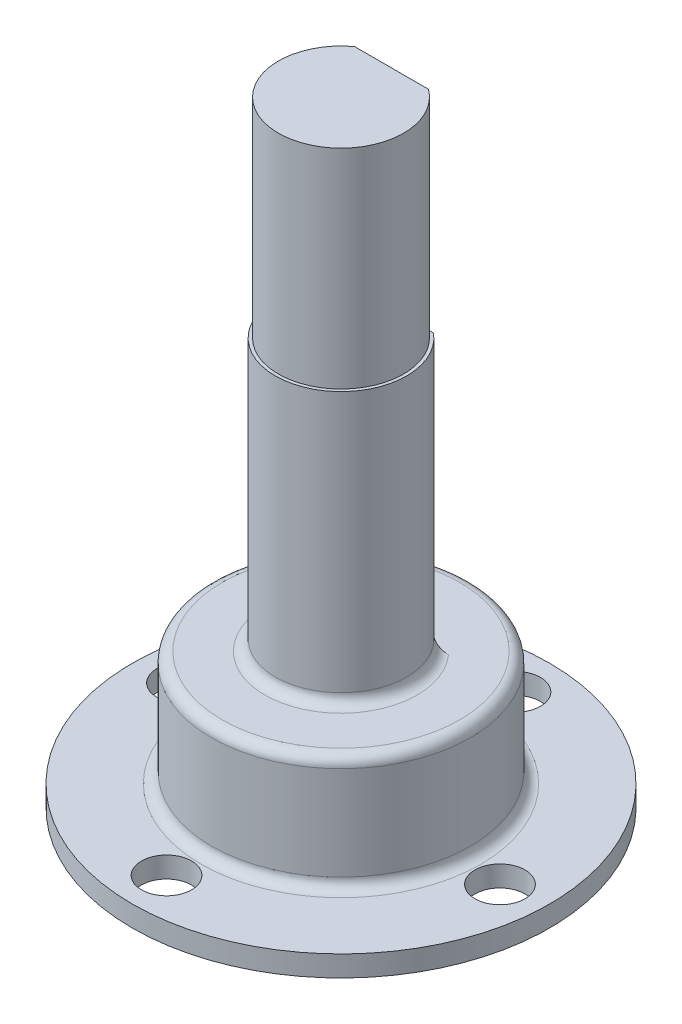
ISO-10303-21;
HEADER;
FILE_DESCRIPTION(('STEP AP214'),'2;1');
FILE_NAME('part.step','',(''),(''),'','','');
FILE_SCHEMA(('AUTOMOTIVE_DESIGN { 1 0 10303 214 1 1 1 1 }'));
ENDSEC;
DATA;
#1=APPLICATION_CONTEXT('core data for automotive mechanical design processes');
#2=APPLICATION_PROTOCOL_DEFINITION('international standard','automotive_design',2000,#1);
#3=PRODUCT_CONTEXT('',#1,'mechanical');
#4=PRODUCT('Part','Part','',(#3));
#5=PRODUCT_RELATED_PRODUCT_CATEGORY('part','',(#4));
#6=PRODUCT_DEFINITION_FORMATION('','',#4);
#7=PRODUCT_DEFINITION_CONTEXT('part definition',#1,'design');
#8=PRODUCT_DEFINITION('design','',#6,#7);
#9=PRODUCT_DEFINITION_SHAPE('','',#8);
#10=(LENGTH_UNIT() NAMED_UNIT(*) SI_UNIT(.MILLI.,.METRE.));
#11=(NAMED_UNIT(*) PLANE_ANGLE_UNIT() SI_UNIT($,.RADIAN.));
#12=(NAMED_UNIT(*) SI_UNIT($,.STERADIAN.) SOLID_ANGLE_UNIT());
#13=UNCERTAINTY_MEASURE_WITH_UNIT(LENGTH_MEASURE(1.E-05),#10,'distance_accuracy_value','');
#14=(GEOMETRIC_REPRESENTATION_CONTEXT(3) GLOBAL_UNCERTAINTY_ASSIGNED_CONTEXT((#13)) GLOBAL_UNIT_ASSIGNED_CONTEXT((#10,
#11,#12)) REPRESENTATION_CONTEXT('',''));
#15=CARTESIAN_POINT('',(0.,0.,0.));
#16=DIRECTION('',(0.,0.,1.));
#17=DIRECTION('',(1.,0.,0.));
#18=AXIS2_PLACEMENT_3D('',#15,#16,#17);
#19=CARTESIAN_POINT('',(0.,29.5,0.));
#20=DIRECTION('',(0.,1.,0.));
#21=DIRECTION('',(0.,0.,1.));
#22=AXIS2_PLACEMENT_3D('',#19,#20,#21);
#23=PLANE('',#22);
#24=DIRECTION('',(1.,0.,0.));
#25=VECTOR('',#24,1.);
#26=CARTESIAN_POINT('',(-3.64134224162171,29.5,-2.42190413345966));
#27=LINE('',#26,#25);
#28=CARTESIAN_POINT('',(-1.7704181337557,29.5,-2.42190413345966));
#29=VERTEX_POINT('',#28);
#30=CARTESIAN_POINT('',(1.7704181337557,29.5,-2.42190413345966));
#31=VERTEX_POINT('',#30);
#32=EDGE_CURVE('E90',#29,#31,#27,.T.);
#33=ORIENTED_EDGE('',*,*,#32,.F.);
#34=CARTESIAN_POINT('',(0.,29.5,0.));
#35=DIRECTION('',(0.,-1.,0.));
#36=DIRECTION('',(0.,0.,-1.));
#37=AXIS2_PLACEMENT_3D('',#34,#35,#36);
#38=CIRCLE('',#37,3.);
#39=EDGE_CURVE('E102',#31,#29,#38,.T.);
#40=ORIENTED_EDGE('',*,*,#39,.F.);
#41=EDGE_LOOP('',(#33,#40));
#42=FACE_BOUND('',#41,.T.);
#43=ADVANCED_FACE('F36',(#42),#23,.T.);
#44=CARTESIAN_POINT('',(0.,3.,0.));
#45=DIRECTION('',(0.,-1.,0.));
#46=DIRECTION('',(0.,0.,-1.));
#47=AXIS2_PLACEMENT_3D('',#44,#45,#46);
#48=CYLINDRICAL_SURFACE('',#47,3.);
#49=DIRECTION('',(0.,-1.,0.));
#50=VECTOR('',#49,1.);
#51=CARTESIAN_POINT('',(-1.7704181337557,3.,-2.42190413345966));
#52=LINE('',#51,#50);
#53=CARTESIAN_POINT('',(-1.77041813375571,19.5,-2.42190413345966));
#54=VERTEX_POINT('',#53);
#55=EDGE_CURVE('E87',#54,#29,#52,.F.);
#56=ORIENTED_EDGE('',*,*,#55,.F.);
#57=CARTESIAN_POINT('',(0.,19.5,0.));
#58=DIRECTION('',(0.,-1.,0.));
#59=DIRECTION('',(0.,0.,-1.));
#60=AXIS2_PLACEMENT_3D('',#57,#58,#59);
#61=CIRCLE('',#60,3.00000000000001);
#62=CARTESIAN_POINT('',(1.77041813375571,19.5,-2.42190413345966));
#63=VERTEX_POINT('',#62);
#64=EDGE_CURVE('E109',#63,#54,#61,.T.);
#65=ORIENTED_EDGE('',*,*,#64,.F.);
#66=DIRECTION('',(0.,-1.,0.));
#67=VECTOR('',#66,1.);
#68=CARTESIAN_POINT('',(1.7704181337557,3.,-2.42190413345966));
#69=LINE('',#68,#67);
#70=EDGE_CURVE('E107',#31,#63,#69,.T.);
#71=ORIENTED_EDGE('',*,*,#70,.F.);
#72=ORIENTED_EDGE('',*,*,#39,.T.);
#73=EDGE_LOOP('',(#56,#65,#71,#72));
#74=FACE_BOUND('',#73,.T.);
#75=ADVANCED_FACE('F106',(#74),#48,.T.);
#76=CARTESIAN_POINT('',(3.00000000000001,19.5,0.));
#77=DIRECTION('',(0.,1.,0.));
#78=DIRECTION('',(0.,0.,1.));
#79=AXIS2_PLACEMENT_3D('',#76,#77,#78);
#80=PLANE('',#79);
#81=DIRECTION('',(1.,0.,0.));
#82=VECTOR('',#81,1.);
#83=CARTESIAN_POINT('',(3.00000000000001,19.5,-2.42190413345966));
#84=LINE('',#83,#82);
#85=CARTESIAN_POINT('',(-2.01416989559744,19.5,-2.42190413345966));
#86=VERTEX_POINT('',#85);
#87=EDGE_CURVE('E93',#86,#54,#84,.T.);
#88=ORIENTED_EDGE('',*,*,#87,.F.);
#89=CARTESIAN_POINT('',(0.,19.5,0.));
#90=DIRECTION('',(0.,-1.,0.));
#91=DIRECTION('',(0.,0.,-1.));
#92=AXIS2_PLACEMENT_3D('',#89,#90,#91);
#93=CIRCLE('',#92,3.15);
#94=CARTESIAN_POINT('',(2.01416989559744,19.5,-2.42190413345966));
#95=VERTEX_POINT('',#94);
#96=EDGE_CURVE('E114',#95,#86,#93,.T.);
#97=ORIENTED_EDGE('',*,*,#96,.F.);
#98=EDGE_CURVE('E199',#63,#95,#84,.T.);
#99=ORIENTED_EDGE('',*,*,#98,.F.);
#100=ORIENTED_EDGE('',*,*,#64,.T.);
#101=EDGE_LOOP('',(#88,#97,#99,#100));
#102=FACE_BOUND('',#101,.T.);
#103=ADVANCED_FACE('F171',(#102),#80,.T.);
#104=CARTESIAN_POINT('',(0.,3.,0.));
#105=DIRECTION('',(0.,-1.,0.));
#106=DIRECTION('',(0.,0.,-1.));
#107=AXIS2_PLACEMENT_3D('',#104,#105,#106);
#108=CYLINDRICAL_SURFACE('',#107,3.15);
#109=DIRECTION('',(0.,-1.,0.));
#110=VECTOR('',#109,1.);
#111=CARTESIAN_POINT('',(-2.01416989559744,3.,-2.42190413345966));
#112=LINE('',#111,#110);
#113=CARTESIAN_POINT('',(-2.01416989559744,7.,-2.42190413345966));
#114=VERTEX_POINT('',#113);
#115=EDGE_CURVE('E207',#114,#86,#112,.F.);
#116=ORIENTED_EDGE('',*,*,#115,.F.);
#117=CARTESIAN_POINT('',(0.,7.,0.));
#118=DIRECTION('',(0.,1.,0.));
#119=DIRECTION('',(0.,0.,1.));
#120=AXIS2_PLACEMENT_3D('',#117,#118,#119);
#121=CIRCLE('',#120,3.15);
#122=CARTESIAN_POINT('',(2.01416989559744,7.,-2.42190413345966));
#123=VERTEX_POINT('',#122);
#124=EDGE_CURVE('E57',#114,#123,#121,.T.);
#125=ORIENTED_EDGE('',*,*,#124,.T.);
#126=DIRECTION('',(0.,-1.,0.));
#127=VECTOR('',#126,1.);
#128=CARTESIAN_POINT('',(2.01416989559744,3.,-2.42190413345966));
#129=LINE('',#128,#127);
#130=EDGE_CURVE('E197',#95,#123,#129,.T.);
#131=ORIENTED_EDGE('',*,*,#130,.F.);
#132=ORIENTED_EDGE('',*,*,#96,.T.);
#133=EDGE_LOOP('',(#116,#125,#131,#132));
#134=FACE_BOUND('',#133,.T.);
#135=ADVANCED_FACE('F167',(#134),#108,.T.);
#136=CARTESIAN_POINT('',(3.15,6.5,0.));
#137=DIRECTION('',(0.,1.,0.));
#138=DIRECTION('',(0.,0.,1.));
#139=AXIS2_PLACEMENT_3D('',#136,#137,#138);
#140=PLANE('',#139);
#141=CARTESIAN_POINT('',(0.,6.5,0.));
#142=DIRECTION('',(0.,1.,0.));
#143=DIRECTION('',(0.,0.,1.));
#144=AXIS2_PLACEMENT_3D('',#141,#142,#143);
#145=CIRCLE('',#144,5.7);
#146=CARTESIAN_POINT('',(0.,6.5,5.7));
#147=VERTEX_POINT('',#146);
#148=EDGE_CURVE('E126',#147,#147,#145,.T.);
#149=ORIENTED_EDGE('',*,*,#148,.T.);
#150=EDGE_LOOP('',(#149));
#151=FACE_BOUND('',#150,.T.);
#152=CARTESIAN_POINT('',(0.,6.5,0.));
#153=DIRECTION('',(0.,1.,0.));
#154=DIRECTION('',(0.,0.,1.));
#155=AXIS2_PLACEMENT_3D('',#152,#153,#154);
#156=CIRCLE('',#155,3.65);
#157=CARTESIAN_POINT('',(2.73072890787991,6.5,-2.42190413345966));
#158=VERTEX_POINT('',#157);
#159=CARTESIAN_POINT('',(-2.73072890787991,6.5,-2.42190413345966));
#160=VERTEX_POINT('',#159);
#161=EDGE_CURVE('E123',#158,#160,#156,.F.);
#162=ORIENTED_EDGE('',*,*,#161,.T.);
#163=DIRECTION('',(-1.,0.,0.));
#164=VECTOR('',#163,1.);
#165=CARTESIAN_POINT('',(-3.64134224162171,6.5,-2.42190413345966));
#166=LINE('',#165,#164);
#167=EDGE_CURVE('E103',#158,#160,#166,.T.);
#168=ORIENTED_EDGE('',*,*,#167,.F.);
#169=EDGE_LOOP('',(#162,#168));
#170=FACE_BOUND('',#169,.T.);
#171=ADVANCED_FACE('F163',(#151,#170),#140,.T.);
#172=CARTESIAN_POINT('',(0.,3.,0.));
#173=DIRECTION('',(0.,-1.,0.));
#174=DIRECTION('',(0.,0.,-1.));
#175=AXIS2_PLACEMENT_3D('',#172,#173,#174);
#176=CYLINDRICAL_SURFACE('',#175,6.2);
#177=CARTESIAN_POINT('',(0.,1.5,0.));
#178=DIRECTION('',(0.,1.,0.));
#179=DIRECTION('',(0.,0.,1.));
#180=AXIS2_PLACEMENT_3D('',#177,#178,#179);
#181=CIRCLE('',#180,6.2);
#182=CARTESIAN_POINT('',(0.,1.5,6.2));
#183=VERTEX_POINT('',#182);
#184=EDGE_CURVE('E120',#183,#183,#181,.T.);
#185=ORIENTED_EDGE('',*,*,#184,.T.);
#186=EDGE_LOOP('',(#185));
#187=FACE_BOUND('',#186,.T.);
#188=CARTESIAN_POINT('',(0.,6.,0.));
#189=DIRECTION('',(0.,1.,0.));
#190=DIRECTION('',(0.,0.,1.));
#191=AXIS2_PLACEMENT_3D('',#188,#189,#190);
#192=CIRCLE('',#191,6.2);
#193=CARTESIAN_POINT('',(0.,6.,6.2));
#194=VERTEX_POINT('',#193);
#195=EDGE_CURVE('E112',#194,#194,#192,.F.);
#196=ORIENTED_EDGE('',*,*,#195,.T.);
#197=EDGE_LOOP('',(#196));
#198=FACE_BOUND('',#197,.T.);
#199=ADVANCED_FACE('F159',(#187,#198),#176,.T.);
#200=CARTESIAN_POINT('',(6.2,1.,0.));
#201=DIRECTION('',(0.,1.,0.));
#202=DIRECTION('',(0.,0.,1.));
#203=AXIS2_PLACEMENT_3D('',#200,#201,#202);
#204=PLANE('',#203);
#205=CARTESIAN_POINT('',(0.,1.,0.));
#206=DIRECTION('',(0.,1.,0.));
#207=DIRECTION('',(0.,0.,1.));
#208=AXIS2_PLACEMENT_3D('',#205,#206,#207);
#209=CIRCLE('',#208,6.7);
#210=CARTESIAN_POINT('',(0.,1.,6.7));
#211=VERTEX_POINT('',#210);
#212=EDGE_CURVE('E108',#211,#211,#209,.F.);
#213=ORIENTED_EDGE('',*,*,#212,.T.);
#214=EDGE_LOOP('',(#213));
#215=FACE_BOUND('',#214,.T.);
#216=CARTESIAN_POINT('',(-7.99137872735473,1.,-0.371303159133185));
#217=DIRECTION('',(0.,1.,0.));
#218=DIRECTION('',(0.,0.,1.));
#219=AXIS2_PLACEMENT_3D('',#216,#217,#218);
#220=CIRCLE('',#219,1.2);
#221=CARTESIAN_POINT('',(-7.99137872735473,1.,0.828696840866815));
#222=VERTEX_POINT('',#221);
#223=EDGE_CURVE('E249',#222,#222,#220,.T.);
#224=ORIENTED_EDGE('',*,*,#223,.F.);
#225=EDGE_LOOP('',(#224));
#226=FACE_BOUND('',#225,.T.);
#227=CARTESIAN_POINT('',(-0.371303159133101,1.,7.99137872735473));
#228=DIRECTION('',(0.,1.,0.));
#229=DIRECTION('',(0.,0.,1.));
#230=AXIS2_PLACEMENT_3D('',#227,#228,#229);
#231=CIRCLE('',#230,1.2);
#232=CARTESIAN_POINT('',(-0.371303159133101,1.,9.19137872735473));
#233=VERTEX_POINT('',#232);
#234=EDGE_CURVE('E243',#233,#233,#231,.T.);
#235=ORIENTED_EDGE('',*,*,#234,.F.);
#236=EDGE_LOOP('',(#235));
#237=FACE_BOUND('',#236,.T.);
#238=CARTESIAN_POINT('',(7.99137872735473,1.,0.371303159133129));
#239=DIRECTION('',(0.,1.,0.));
#240=DIRECTION('',(0.,0.,1.));
#241=AXIS2_PLACEMENT_3D('',#238,#239,#240);
#242=CIRCLE('',#241,1.2);
#243=CARTESIAN_POINT('',(7.99137872735473,1.,1.57130315913313));
#244=VERTEX_POINT('',#243);
#245=EDGE_CURVE('E237',#244,#244,#242,.T.);
#246=ORIENTED_EDGE('',*,*,#245,.F.);
#247=EDGE_LOOP('',(#246));
#248=FACE_BOUND('',#247,.T.);
#249=CARTESIAN_POINT('',(0.371303159133101,1.,-7.99137872735473));
#250=DIRECTION('',(0.,1.,0.));
#251=DIRECTION('',(0.,0.,1.));
#252=AXIS2_PLACEMENT_3D('',#249,#250,#251);
#253=CIRCLE('',#252,1.2);
#254=CARTESIAN_POINT('',(0.371303159133101,1.,-6.79137872735473));
#255=VERTEX_POINT('',#254);
#256=EDGE_CURVE('E231',#255,#255,#253,.T.);
#257=ORIENTED_EDGE('',*,*,#256,.F.);
#258=EDGE_LOOP('',(#257));
#259=FACE_BOUND('',#258,.T.);
#260=CARTESIAN_POINT('',(0.,1.,0.));
#261=DIRECTION('',(0.,-1.,0.));
#262=DIRECTION('',(0.,0.,-1.));
#263=AXIS2_PLACEMENT_3D('',#260,#261,#262);
#264=CIRCLE('',#263,10.);
#265=CARTESIAN_POINT('',(0.,1.,-10.));
#266=VERTEX_POINT('',#265);
#267=EDGE_CURVE('E217',#266,#266,#264,.T.);
#268=ORIENTED_EDGE('',*,*,#267,.F.);
#269=EDGE_LOOP('',(#268));
#270=FACE_BOUND('',#269,.T.);
#271=ADVANCED_FACE('F155',(#215,#226,#237,#248,#259,#270),#204,.T.);
#272=CARTESIAN_POINT('',(0.,3.,0.));
#273=DIRECTION('',(0.,-1.,0.));
#274=DIRECTION('',(0.,0.,-1.));
#275=AXIS2_PLACEMENT_3D('',#272,#273,#274);
#276=CYLINDRICAL_SURFACE('',#275,10.);
#277=ORIENTED_EDGE('',*,*,#267,.T.);
#278=EDGE_LOOP('',(#277));
#279=FACE_BOUND('',#278,.T.);
#280=CARTESIAN_POINT('',(0.,0.,0.));
#281=DIRECTION('',(0.,-1.,0.));
#282=DIRECTION('',(0.,0.,-1.));
#283=AXIS2_PLACEMENT_3D('',#280,#281,#282);
#284=CIRCLE('',#283,10.);
#285=CARTESIAN_POINT('',(0.,0.,-10.));
#286=VERTEX_POINT('',#285);
#287=EDGE_CURVE('E214',#286,#286,#284,.T.);
#288=ORIENTED_EDGE('',*,*,#287,.F.);
#289=EDGE_LOOP('',(#288));
#290=FACE_BOUND('',#289,.T.);
#291=ADVANCED_FACE('F151',(#279,#290),#276,.T.);
#292=CARTESIAN_POINT('',(10.,0.,0.));
#293=DIRECTION('',(0.,-1.,0.));
#294=DIRECTION('',(0.,0.,-1.));
#295=AXIS2_PLACEMENT_3D('',#292,#293,#294);
#296=PLANE('',#295);
#297=CARTESIAN_POINT('',(-7.99137872735473,0.,-0.371303159133185));
#298=DIRECTION('',(0.,-1.,0.));
#299=DIRECTION('',(0.,0.,-1.));
#300=AXIS2_PLACEMENT_3D('',#297,#298,#299);
#301=CIRCLE('',#300,1.2);
#302=CARTESIAN_POINT('',(-7.99137872735473,0.,-1.57130315913318));
#303=VERTEX_POINT('',#302);
#304=EDGE_CURVE('E246',#303,#303,#301,.T.);
#305=ORIENTED_EDGE('',*,*,#304,.F.);
#306=EDGE_LOOP('',(#305));
#307=FACE_BOUND('',#306,.T.);
#308=CARTESIAN_POINT('',(-0.371303159133101,0.,7.99137872735473));
#309=DIRECTION('',(0.,-1.,0.));
#310=DIRECTION('',(0.,0.,-1.));
#311=AXIS2_PLACEMENT_3D('',#308,#309,#310);
#312=CIRCLE('',#311,1.2);
#313=CARTESIAN_POINT('',(-0.371303159133101,0.,6.79137872735473));
#314=VERTEX_POINT('',#313);
#315=EDGE_CURVE('E240',#314,#314,#312,.T.);
#316=ORIENTED_EDGE('',*,*,#315,.F.);
#317=EDGE_LOOP('',(#316));
#318=FACE_BOUND('',#317,.T.);
#319=CARTESIAN_POINT('',(7.99137872735473,0.,0.371303159133129));
#320=DIRECTION('',(0.,-1.,0.));
#321=DIRECTION('',(0.,0.,-1.));
#322=AXIS2_PLACEMENT_3D('',#319,#320,#321);
#323=CIRCLE('',#322,1.2);
#324=CARTESIAN_POINT('',(7.99137872735473,0.,-0.82869684086687));
#325=VERTEX_POINT('',#324);
#326=EDGE_CURVE('E234',#325,#325,#323,.T.);
#327=ORIENTED_EDGE('',*,*,#326,.F.);
#328=EDGE_LOOP('',(#327));
#329=FACE_BOUND('',#328,.T.);
#330=CARTESIAN_POINT('',(0.371303159133101,0.,-7.99137872735473));
#331=DIRECTION('',(0.,-1.,0.));
#332=DIRECTION('',(0.,0.,-1.));
#333=AXIS2_PLACEMENT_3D('',#330,#331,#332);
#334=CIRCLE('',#333,1.2);
#335=CARTESIAN_POINT('',(0.371303159133101,0.,-9.19137872735473));
#336=VERTEX_POINT('',#335);
#337=EDGE_CURVE('E104',#336,#336,#334,.T.);
#338=ORIENTED_EDGE('',*,*,#337,.F.);
#339=EDGE_LOOP('',(#338));
#340=FACE_BOUND('',#339,.T.);
#341=ORIENTED_EDGE('',*,*,#287,.T.);
#342=EDGE_LOOP('',(#341));
#343=FACE_BOUND('',#342,.T.);
#344=CARTESIAN_POINT('',(0.,0.,0.));
#345=DIRECTION('',(0.,-1.,0.));
#346=DIRECTION('',(0.,0.,-1.));
#347=AXIS2_PLACEMENT_3D('',#344,#345,#346);
#348=CIRCLE('',#347,4.5);
#349=CARTESIAN_POINT('',(0.,0.,-4.5));
#350=VERTEX_POINT('',#349);
#351=EDGE_CURVE('E211',#350,#350,#348,.T.);
#352=ORIENTED_EDGE('',*,*,#351,.F.);
#353=EDGE_LOOP('',(#352));
#354=FACE_BOUND('',#353,.T.);
#355=ADVANCED_FACE('F147',(#307,#318,#329,#340,#343,#354),#296,.T.);
#356=CARTESIAN_POINT('',(0.,3.,0.));
#357=DIRECTION('',(0.,-1.,0.));
#358=DIRECTION('',(0.,0.,-1.));
#359=AXIS2_PLACEMENT_3D('',#356,#357,#358);
#360=CYLINDRICAL_SURFACE('',#359,4.5);
#361=ORIENTED_EDGE('',*,*,#351,.T.);
#362=EDGE_LOOP('',(#361));
#363=FACE_BOUND('',#362,.T.);
#364=CARTESIAN_POINT('',(0.,3.,0.));
#365=DIRECTION('',(0.,-1.,0.));
#366=DIRECTION('',(0.,0.,-1.));
#367=AXIS2_PLACEMENT_3D('',#364,#365,#366);
#368=CIRCLE('',#367,4.5);
#369=CARTESIAN_POINT('',(0.,3.,-4.5));
#370=VERTEX_POINT('',#369);
#371=EDGE_CURVE('E98',#370,#370,#368,.T.);
#372=ORIENTED_EDGE('',*,*,#371,.F.);
#373=EDGE_LOOP('',(#372));
#374=FACE_BOUND('',#373,.T.);
#375=ADVANCED_FACE('F143',(#363,#374),#360,.F.);
#376=CARTESIAN_POINT('',(4.5,3.,0.));
#377=DIRECTION('',(0.,-1.,0.));
#378=DIRECTION('',(0.,0.,-1.));
#379=AXIS2_PLACEMENT_3D('',#376,#377,#378);
#380=PLANE('',#379);
#381=ORIENTED_EDGE('',*,*,#371,.T.);
#382=EDGE_LOOP('',(#381));
#383=FACE_BOUND('',#382,.T.);
#384=ADVANCED_FACE('F138',(#383),#380,.T.);
#385=CARTESIAN_POINT('',(-3.64134224162171,-0.222301771314604,-2.42190413345966));
#386=DIRECTION('',(0.,0.,1.));
#387=DIRECTION('',(1.,0.,0.));
#388=AXIS2_PLACEMENT_3D('',#385,#386,#387);
#389=PLANE('',#388);
#390=ORIENTED_EDGE('',*,*,#55,.T.);
#391=ORIENTED_EDGE('',*,*,#32,.T.);
#392=ORIENTED_EDGE('',*,*,#70,.T.);
#393=ORIENTED_EDGE('',*,*,#98,.T.);
#394=ORIENTED_EDGE('',*,*,#130,.T.);
#395=CARTESIAN_POINT('',(2.01416989559744,7.,-2.42190413345966));
#396=CARTESIAN_POINT('',(2.01410251492904,6.97836536570635,-2.42190413345966));
#397=CARTESIAN_POINT('',(2.01636181038486,6.95681778662002,-2.42190413345966));
#398=CARTESIAN_POINT('',(2.02490984326628,6.91478724598333,-2.42190413345966));
#399=CARTESIAN_POINT('',(2.03115091115904,6.89429474849456,-2.42190413345966));
#400=CARTESIAN_POINT('',(2.04702757630945,6.85481779019472,-2.42190413345966));
#401=CARTESIAN_POINT('',(2.05664738323025,6.83582680943459,-2.42190413345966));
#402=CARTESIAN_POINT('',(2.07860147607339,6.79943433222572,-2.42190413345966));
#403=CARTESIAN_POINT('',(2.09094446794697,6.78203819283065,-2.42190413345966));
#404=CARTESIAN_POINT('',(2.12504561313686,6.73991431343108,-2.42190413345966));
#405=CARTESIAN_POINT('',(2.14826423824995,6.71637120283324,-2.42190413345966));
#406=CARTESIAN_POINT('',(2.19807954578482,6.67319553587424,-2.42190413345966));
#407=CARTESIAN_POINT('',(2.22468391532608,6.65357214798915,-2.42190413345966));
#408=CARTESIAN_POINT('',(2.29197143448726,6.61047003148581,-2.42190413345966));
#409=CARTESIAN_POINT('',(2.33385433334388,6.58886454486127,-2.42190413345966));
#410=CARTESIAN_POINT('',(2.42049947655845,6.55261526163959,-2.42190413345966));
#411=CARTESIAN_POINT('',(2.46526378422213,6.5379765181534,-2.42190413345966));
#412=CARTESIAN_POINT('',(2.54687820951525,6.5179366821242,-2.42190413345966));
#413=CARTESIAN_POINT('',(2.58341582475566,6.51124114471195,-2.42190413345966));
#414=CARTESIAN_POINT('',(2.65687358803554,6.50229131847252,-2.42190413345966));
#415=CARTESIAN_POINT('',(2.69379148020802,6.50001846459261,-2.42190413345966));
#416=CARTESIAN_POINT('',(2.73072890787991,6.5,-2.42190413345966));
#417=B_SPLINE_CURVE_WITH_KNOTS('',3,(#395,#396,#397,#398,#399,#400,#401,#402,#403,#404,#405,
#406,#407,#408,#409,#410,#411,#412,#413,#414,#415,#416),.UNSPECIFIED.,.F.,.F.,(4,2,2,2,2,2,2,2,
2,2,4),(0.,0.0646484168161596,0.128537030004227,0.192130951588462,0.255931205802623,
0.354575234680528,0.453447363614596,0.594086953761744,0.734828397587733,0.846009273845688,
0.95672243185232),.UNSPECIFIED.);
#418=EDGE_CURVE('E11',#123,#158,#417,.T.);
#419=ORIENTED_EDGE('',*,*,#418,.T.);
#420=ORIENTED_EDGE('',*,*,#167,.T.);
#421=CARTESIAN_POINT('',(-2.73072890787991,6.5,-2.42190413345966));
#422=CARTESIAN_POINT('',(-2.70488033474315,6.50000519389752,-2.42190413345966));
#423=CARTESIAN_POINT('',(-2.67905147398319,6.50112171072178,-2.42190413345966));
#424=CARTESIAN_POINT('',(-2.62757171281522,6.50552486168541,-2.42190413345966));
#425=CARTESIAN_POINT('',(-2.60192086293555,6.50881208841135,-2.42190413345966));
#426=CARTESIAN_POINT('',(-2.52512820183031,6.52190740454944,-2.42190413345966));
#427=CARTESIAN_POINT('',(-2.4744913089387,6.53494785050639,-2.42190413345966));
#428=CARTESIAN_POINT('',(-2.38492020987793,6.5664324779675,-2.42190413345966));
#429=CARTESIAN_POINT('',(-2.34549871738448,6.58351538972083,-2.42190413345966));
#430=CARTESIAN_POINT('',(-2.26985033077688,6.62363332665786,-2.42190413345966));
#431=CARTESIAN_POINT('',(-2.23361421500322,6.64665035678255,-2.42190413345966));
#432=CARTESIAN_POINT('',(-2.17793561238694,6.68992899005655,-2.42190413345966));
#433=CARTESIAN_POINT('',(-2.15705210107936,6.70833880323115,-2.42190413345966));
#434=CARTESIAN_POINT('',(-2.11819764091185,6.74804109043111,-2.42190413345966));
#435=CARTESIAN_POINT('',(-2.10022331697794,6.76933017066612,-2.42190413345966));
#436=CARTESIAN_POINT('',(-2.07200031980793,6.80958914418465,-2.42190413345966));
#437=CARTESIAN_POINT('',(-2.06092492494651,6.82797577028556,-2.42190413345966));
#438=CARTESIAN_POINT('',(-2.04190375158941,6.86627483571122,-2.42190413345966));
#439=CARTESIAN_POINT('',(-2.03394865525568,6.8861825168023,-2.42190413345966));
#440=CARTESIAN_POINT('',(-2.02342525080204,6.92174208920339,-2.42190413345966));
#441=CARTESIAN_POINT('',(-2.01999085895195,6.93713829679148,-2.42190413345966));
#442=CARTESIAN_POINT('',(-2.01534626515479,6.9683468658524,-2.42190413345966));
#443=CARTESIAN_POINT('',(-2.01414850529248,6.98416106187478,-2.42190413345966));
#444=CARTESIAN_POINT('',(-2.01416989559749,7.00000000000002,-2.42190413345966));
#445=B_SPLINE_CURVE_WITH_KNOTS('',3,(#421,#422,#423,#424,#425,#426,#427,#428,#429,#430,#431,
#432,#433,#434,#435,#436,#437,#438,#439,#440,#441,#442,#443,#444),.UNSPECIFIED.,.F.,.F.,(4,2,2,
2,2,2,2,2,2,2,2,4),(0.,0.0774850868345583,0.154991335232288,0.311026500897649,0.439501641903988,
0.567591676363427,0.650882788434768,0.734076567310735,0.798242047457128,0.862214430631376,
0.909383074076126,0.956813337588575),.UNSPECIFIED.);
#446=EDGE_CURVE('E50',#160,#114,#445,.T.);
#447=ORIENTED_EDGE('',*,*,#446,.T.);
#448=ORIENTED_EDGE('',*,*,#115,.T.);
#449=ORIENTED_EDGE('',*,*,#87,.T.);
#450=EDGE_LOOP('',(#390,#391,#392,#393,#394,#419,#420,#447,#448,#449));
#451=FACE_BOUND('',#450,.T.);
#452=ADVANCED_FACE('F89',(#451),#389,.F.);
#453=CARTESIAN_POINT('',(0.371303159133101,1.,-7.99137872735473));
#454=DIRECTION('',(0.,1.,0.));
#455=DIRECTION('',(0.,0.,1.));
#456=AXIS2_PLACEMENT_3D('',#453,#454,#455);
#457=CYLINDRICAL_SURFACE('',#456,1.2);
#458=ORIENTED_EDGE('',*,*,#256,.T.);
#459=EDGE_LOOP('',(#458));
#460=FACE_BOUND('',#459,.T.);
#461=ORIENTED_EDGE('',*,*,#337,.T.);
#462=EDGE_LOOP('',(#461));
#463=FACE_BOUND('',#462,.T.);
#464=ADVANCED_FACE('F137',(#460,#463),#457,.F.);
#465=CARTESIAN_POINT('',(7.99137872735473,1.,0.371303159133129));
#466=DIRECTION('',(0.,1.,0.));
#467=DIRECTION('',(0.,0.,1.));
#468=AXIS2_PLACEMENT_3D('',#465,#466,#467);
#469=CYLINDRICAL_SURFACE('',#468,1.2);
#470=ORIENTED_EDGE('',*,*,#245,.T.);
#471=EDGE_LOOP('',(#470));
#472=FACE_BOUND('',#471,.T.);
#473=ORIENTED_EDGE('',*,*,#326,.T.);
#474=EDGE_LOOP('',(#473));
#475=FACE_BOUND('',#474,.T.);
#476=ADVANCED_FACE('F264',(#472,#475),#469,.F.);
#477=CARTESIAN_POINT('',(-0.371303159133101,1.,7.99137872735473));
#478=DIRECTION('',(0.,1.,0.));
#479=DIRECTION('',(0.,0.,1.));
#480=AXIS2_PLACEMENT_3D('',#477,#478,#479);
#481=CYLINDRICAL_SURFACE('',#480,1.2);
#482=ORIENTED_EDGE('',*,*,#234,.T.);
#483=EDGE_LOOP('',(#482));
#484=FACE_BOUND('',#483,.T.);
#485=ORIENTED_EDGE('',*,*,#315,.T.);
#486=EDGE_LOOP('',(#485));
#487=FACE_BOUND('',#486,.T.);
#488=ADVANCED_FACE('F270',(#484,#487),#481,.F.);
#489=CARTESIAN_POINT('',(-7.99137872735473,1.,-0.371303159133185));
#490=DIRECTION('',(0.,1.,0.));
#491=DIRECTION('',(0.,0.,1.));
#492=AXIS2_PLACEMENT_3D('',#489,#490,#491);
#493=CYLINDRICAL_SURFACE('',#492,1.2);
#494=ORIENTED_EDGE('',*,*,#223,.T.);
#495=EDGE_LOOP('',(#494));
#496=FACE_BOUND('',#495,.T.);
#497=ORIENTED_EDGE('',*,*,#304,.T.);
#498=EDGE_LOOP('',(#497));
#499=FACE_BOUND('',#498,.T.);
#500=ADVANCED_FACE('F182',(#496,#499),#493,.F.);
#501=CARTESIAN_POINT('',(0.,1.5,0.));
#502=DIRECTION('',(0.,1.,0.));
#503=DIRECTION('',(0.,0.,1.));
#504=AXIS2_PLACEMENT_3D('',#501,#502,#503);
#505=TOROIDAL_SURFACE('',#504,6.7,0.5);
#506=ORIENTED_EDGE('',*,*,#184,.F.);
#507=EDGE_LOOP('',(#506));
#508=FACE_BOUND('',#507,.T.);
#509=ORIENTED_EDGE('',*,*,#212,.F.);
#510=EDGE_LOOP('',(#509));
#511=FACE_BOUND('',#510,.T.);
#512=ADVANCED_FACE('F179',(#508,#511),#505,.F.);
#513=CARTESIAN_POINT('',(0.,6.,0.));
#514=DIRECTION('',(0.,1.,0.));
#515=DIRECTION('',(0.,0.,1.));
#516=AXIS2_PLACEMENT_3D('',#513,#514,#515);
#517=TOROIDAL_SURFACE('',#516,5.7,0.5);
#518=ORIENTED_EDGE('',*,*,#148,.F.);
#519=EDGE_LOOP('',(#518));
#520=FACE_BOUND('',#519,.T.);
#521=ORIENTED_EDGE('',*,*,#195,.F.);
#522=EDGE_LOOP('',(#521));
#523=FACE_BOUND('',#522,.T.);
#524=ADVANCED_FACE('F181',(#520,#523),#517,.T.);
#525=CARTESIAN_POINT('',(0.,7.,0.));
#526=DIRECTION('',(0.,1.,0.));
#527=DIRECTION('',(0.,0.,1.));
#528=AXIS2_PLACEMENT_3D('',#525,#526,#527);
#529=TOROIDAL_SURFACE('',#528,3.65,0.5);
#530=ORIENTED_EDGE('',*,*,#418,.F.);
#531=ORIENTED_EDGE('',*,*,#124,.F.);
#532=ORIENTED_EDGE('',*,*,#446,.F.);
#533=ORIENTED_EDGE('',*,*,#161,.F.);
#534=EDGE_LOOP('',(#530,#531,#532,#533));
#535=FACE_BOUND('',#534,.T.);
#536=ADVANCED_FACE('F38',(#535),#529,.F.);
#537=CLOSED_SHELL('',(#43,#75,#103,#135,#171,#199,#271,#291,#355,#375,#384,#452,#464,#476,#488,
#500,#512,#524,#536));
#538=MANIFOLD_SOLID_BREP('B2',#537);
#539=ADVANCED_BREP_SHAPE_REPRESENTATION('',(#18,#538),#14);
#540=SHAPE_DEFINITION_REPRESENTATION(#9,#539);
ENDSEC;
END-ISO-10303-21;
